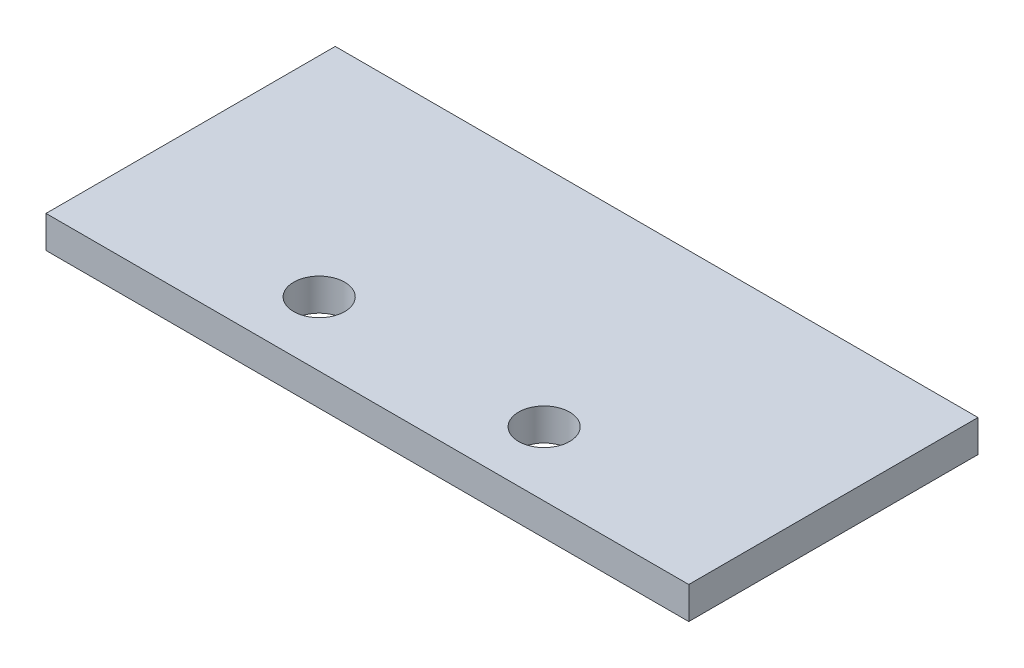
ISO-10303-21;
HEADER;
FILE_DESCRIPTION(('STEP AP214'),'2;1');
FILE_NAME('part.step','',(''),(''),'','','');
FILE_SCHEMA(('AUTOMOTIVE_DESIGN { 1 0 10303 214 1 1 1 1 }'));
ENDSEC;
DATA;
#1=APPLICATION_CONTEXT('core data for automotive mechanical design processes');
#2=APPLICATION_PROTOCOL_DEFINITION('international standard','automotive_design',2000,#1);
#3=PRODUCT_CONTEXT('',#1,'mechanical');
#4=PRODUCT('Part','Part','',(#3));
#5=PRODUCT_RELATED_PRODUCT_CATEGORY('part','',(#4));
#6=PRODUCT_DEFINITION_FORMATION('','',#4);
#7=PRODUCT_DEFINITION_CONTEXT('part definition',#1,'design');
#8=PRODUCT_DEFINITION('design','',#6,#7);
#9=PRODUCT_DEFINITION_SHAPE('','',#8);
#10=(LENGTH_UNIT() NAMED_UNIT(*) SI_UNIT(.MILLI.,.METRE.));
#11=(NAMED_UNIT(*) PLANE_ANGLE_UNIT() SI_UNIT($,.RADIAN.));
#12=(NAMED_UNIT(*) SI_UNIT($,.STERADIAN.) SOLID_ANGLE_UNIT());
#13=UNCERTAINTY_MEASURE_WITH_UNIT(LENGTH_MEASURE(1.E-05),#10,'distance_accuracy_value','');
#14=(GEOMETRIC_REPRESENTATION_CONTEXT(3) GLOBAL_UNCERTAINTY_ASSIGNED_CONTEXT((#13)) GLOBAL_UNIT_ASSIGNED_CONTEXT((#10,
#11,#12)) REPRESENTATION_CONTEXT('',''));
#15=CARTESIAN_POINT('',(0.,0.,0.));
#16=DIRECTION('',(0.,0.,1.));
#17=DIRECTION('',(1.,0.,0.));
#18=AXIS2_PLACEMENT_3D('',#15,#16,#17);
#19=CARTESIAN_POINT('',(0.,6.35,0.));
#20=DIRECTION('',(1.,0.,0.));
#21=DIRECTION('',(0.,0.,-1.));
#22=AXIS2_PLACEMENT_3D('',#19,#20,#21);
#23=PLANE('',#22);
#24=DIRECTION('',(0.,0.,1.));
#25=VECTOR('',#24,1.);
#26=CARTESIAN_POINT('',(0.,0.,0.));
#27=LINE('',#26,#25);
#28=CARTESIAN_POINT('',(0.,0.,-57.15));
#29=VERTEX_POINT('',#28);
#30=CARTESIAN_POINT('',(0.,0.,0.));
#31=VERTEX_POINT('',#30);
#32=EDGE_CURVE('E95',#29,#31,#27,.T.);
#33=ORIENTED_EDGE('',*,*,#32,.T.);
#34=DIRECTION('',(0.,-1.,0.));
#35=VECTOR('',#34,1.);
#36=CARTESIAN_POINT('',(0.,6.35,0.));
#37=LINE('',#36,#35);
#38=CARTESIAN_POINT('',(0.,6.35,0.));
#39=VERTEX_POINT('',#38);
#40=EDGE_CURVE('E11',#39,#31,#37,.T.);
#41=ORIENTED_EDGE('',*,*,#40,.F.);
#42=DIRECTION('',(0.,0.,1.));
#43=VECTOR('',#42,1.);
#44=CARTESIAN_POINT('',(0.,6.35,0.));
#45=LINE('',#44,#43);
#46=CARTESIAN_POINT('',(0.,6.35,-57.15));
#47=VERTEX_POINT('',#46);
#48=EDGE_CURVE('E83',#47,#39,#45,.T.);
#49=ORIENTED_EDGE('',*,*,#48,.F.);
#50=DIRECTION('',(0.,-1.,0.));
#51=VECTOR('',#50,1.);
#52=CARTESIAN_POINT('',(0.,6.35,-57.15));
#53=LINE('',#52,#51);
#54=EDGE_CURVE('E91',#47,#29,#53,.T.);
#55=ORIENTED_EDGE('',*,*,#54,.T.);
#56=EDGE_LOOP('',(#33,#41,#49,#55));
#57=FACE_BOUND('',#56,.T.);
#58=ADVANCED_FACE('F32',(#57),#23,.F.);
#59=CARTESIAN_POINT('',(0.,6.35,0.));
#60=DIRECTION('',(0.,0.,-1.));
#61=DIRECTION('',(-1.,0.,0.));
#62=AXIS2_PLACEMENT_3D('',#59,#60,#61);
#63=PLANE('',#62);
#64=DIRECTION('',(1.,0.,0.));
#65=VECTOR('',#64,1.);
#66=CARTESIAN_POINT('',(0.,0.,0.));
#67=LINE('',#66,#65);
#68=CARTESIAN_POINT('',(127.,0.,0.));
#69=VERTEX_POINT('',#68);
#70=EDGE_CURVE('E87',#31,#69,#67,.T.);
#71=ORIENTED_EDGE('',*,*,#70,.T.);
#72=DIRECTION('',(0.,-1.,0.));
#73=VECTOR('',#72,1.);
#74=CARTESIAN_POINT('',(127.,6.35,0.));
#75=LINE('',#74,#73);
#76=CARTESIAN_POINT('',(127.,6.35,0.));
#77=VERTEX_POINT('',#76);
#78=EDGE_CURVE('E40',#77,#69,#75,.T.);
#79=ORIENTED_EDGE('',*,*,#78,.F.);
#80=DIRECTION('',(1.,0.,0.));
#81=VECTOR('',#80,1.);
#82=CARTESIAN_POINT('',(0.,6.35,0.));
#83=LINE('',#82,#81);
#84=EDGE_CURVE('E78',#39,#77,#83,.T.);
#85=ORIENTED_EDGE('',*,*,#84,.F.);
#86=ORIENTED_EDGE('',*,*,#40,.T.);
#87=EDGE_LOOP('',(#71,#79,#85,#86));
#88=FACE_BOUND('',#87,.T.);
#89=ADVANCED_FACE('F86',(#88),#63,.F.);
#90=CARTESIAN_POINT('',(127.,6.35,0.));
#91=DIRECTION('',(-1.,0.,0.));
#92=DIRECTION('',(0.,0.,1.));
#93=AXIS2_PLACEMENT_3D('',#90,#91,#92);
#94=PLANE('',#93);
#95=DIRECTION('',(0.,0.,-1.));
#96=VECTOR('',#95,1.);
#97=CARTESIAN_POINT('',(127.,0.,0.));
#98=LINE('',#97,#96);
#99=CARTESIAN_POINT('',(127.,0.,-57.15));
#100=VERTEX_POINT('',#99);
#101=EDGE_CURVE('E65',#69,#100,#98,.T.);
#102=ORIENTED_EDGE('',*,*,#101,.T.);
#103=DIRECTION('',(0.,-1.,0.));
#104=VECTOR('',#103,1.);
#105=CARTESIAN_POINT('',(127.,6.35,-57.15));
#106=LINE('',#105,#104);
#107=CARTESIAN_POINT('',(127.,6.35,-57.15));
#108=VERTEX_POINT('',#107);
#109=EDGE_CURVE('E88',#108,#100,#106,.T.);
#110=ORIENTED_EDGE('',*,*,#109,.F.);
#111=DIRECTION('',(0.,0.,-1.));
#112=VECTOR('',#111,1.);
#113=CARTESIAN_POINT('',(127.,6.35,0.));
#114=LINE('',#113,#112);
#115=EDGE_CURVE('E81',#77,#108,#114,.T.);
#116=ORIENTED_EDGE('',*,*,#115,.F.);
#117=ORIENTED_EDGE('',*,*,#78,.T.);
#118=EDGE_LOOP('',(#102,#110,#116,#117));
#119=FACE_BOUND('',#118,.T.);
#120=ADVANCED_FACE('F89',(#119),#94,.F.);
#121=CARTESIAN_POINT('',(0.,6.35,-57.15));
#122=DIRECTION('',(0.,0.,1.));
#123=DIRECTION('',(1.,0.,0.));
#124=AXIS2_PLACEMENT_3D('',#121,#122,#123);
#125=PLANE('',#124);
#126=DIRECTION('',(-1.,0.,0.));
#127=VECTOR('',#126,1.);
#128=CARTESIAN_POINT('',(0.,0.,-57.15));
#129=LINE('',#128,#127);
#130=EDGE_CURVE('E71',#100,#29,#129,.T.);
#131=ORIENTED_EDGE('',*,*,#130,.T.);
#132=ORIENTED_EDGE('',*,*,#54,.F.);
#133=DIRECTION('',(-1.,0.,0.));
#134=VECTOR('',#133,1.);
#135=CARTESIAN_POINT('',(0.,6.35,-57.15));
#136=LINE('',#135,#134);
#137=EDGE_CURVE('E48',#108,#47,#136,.T.);
#138=ORIENTED_EDGE('',*,*,#137,.F.);
#139=ORIENTED_EDGE('',*,*,#109,.T.);
#140=EDGE_LOOP('',(#131,#132,#138,#139));
#141=FACE_BOUND('',#140,.T.);
#142=ADVANCED_FACE('F103',(#141),#125,.F.);
#143=CARTESIAN_POINT('',(0.,6.35,0.));
#144=DIRECTION('',(0.,-1.,0.));
#145=DIRECTION('',(0.,0.,-1.));
#146=AXIS2_PLACEMENT_3D('',#143,#144,#145);
#147=PLANE('',#146);
#148=CARTESIAN_POINT('',(85.7250000000008,6.35,-12.7000000000001));
#149=DIRECTION('',(0.,1.,0.));
#150=DIRECTION('',(0.,0.,1.));
#151=AXIS2_PLACEMENT_3D('',#148,#149,#150);
#152=CIRCLE('',#151,5.0419);
#153=CARTESIAN_POINT('',(85.7250000000008,6.35,-7.65810000000007));
#154=VERTEX_POINT('',#153);
#155=EDGE_CURVE('E115',#154,#154,#152,.T.);
#156=ORIENTED_EDGE('',*,*,#155,.F.);
#157=EDGE_LOOP('',(#156));
#158=FACE_BOUND('',#157,.T.);
#159=CARTESIAN_POINT('',(41.2750000000008,6.35,-12.7000000000001));
#160=DIRECTION('',(0.,1.,0.));
#161=DIRECTION('',(0.,0.,1.));
#162=AXIS2_PLACEMENT_3D('',#159,#160,#161);
#163=CIRCLE('',#162,5.0419);
#164=CARTESIAN_POINT('',(41.2750000000008,6.35,-7.65810000000007));
#165=VERTEX_POINT('',#164);
#166=EDGE_CURVE('E109',#165,#165,#163,.T.);
#167=ORIENTED_EDGE('',*,*,#166,.F.);
#168=EDGE_LOOP('',(#167));
#169=FACE_BOUND('',#168,.T.);
#170=ORIENTED_EDGE('',*,*,#48,.T.);
#171=ORIENTED_EDGE('',*,*,#84,.T.);
#172=ORIENTED_EDGE('',*,*,#115,.T.);
#173=ORIENTED_EDGE('',*,*,#137,.T.);
#174=EDGE_LOOP('',(#170,#171,#172,#173));
#175=FACE_BOUND('',#174,.T.);
#176=ADVANCED_FACE('F79',(#158,#169,#175),#147,.F.);
#177=CARTESIAN_POINT('',(0.,0.,0.));
#178=DIRECTION('',(0.,-1.,0.));
#179=DIRECTION('',(0.,0.,-1.));
#180=AXIS2_PLACEMENT_3D('',#177,#178,#179);
#181=PLANE('',#180);
#182=CARTESIAN_POINT('',(85.7250000000008,0.,-12.7000000000001));
#183=DIRECTION('',(0.,1.,0.));
#184=DIRECTION('',(0.,0.,1.));
#185=AXIS2_PLACEMENT_3D('',#182,#183,#184);
#186=CIRCLE('',#185,5.0419);
#187=CARTESIAN_POINT('',(85.7250000000008,0.,-7.65810000000007));
#188=VERTEX_POINT('',#187);
#189=EDGE_CURVE('E112',#188,#188,#186,.T.);
#190=ORIENTED_EDGE('',*,*,#189,.T.);
#191=EDGE_LOOP('',(#190));
#192=FACE_BOUND('',#191,.T.);
#193=CARTESIAN_POINT('',(41.2750000000008,0.,-12.7000000000001));
#194=DIRECTION('',(0.,1.,0.));
#195=DIRECTION('',(0.,0.,1.));
#196=AXIS2_PLACEMENT_3D('',#193,#194,#195);
#197=CIRCLE('',#196,5.0419);
#198=CARTESIAN_POINT('',(41.2750000000008,0.,-7.65810000000007));
#199=VERTEX_POINT('',#198);
#200=EDGE_CURVE('E98',#199,#199,#197,.T.);
#201=ORIENTED_EDGE('',*,*,#200,.T.);
#202=EDGE_LOOP('',(#201));
#203=FACE_BOUND('',#202,.T.);
#204=ORIENTED_EDGE('',*,*,#32,.F.);
#205=ORIENTED_EDGE('',*,*,#130,.F.);
#206=ORIENTED_EDGE('',*,*,#101,.F.);
#207=ORIENTED_EDGE('',*,*,#70,.F.);
#208=EDGE_LOOP('',(#204,#205,#206,#207));
#209=FACE_BOUND('',#208,.T.);
#210=ADVANCED_FACE('F106',(#192,#203,#209),#181,.T.);
#211=CARTESIAN_POINT('',(41.2750000000008,0.,-12.7000000000001));
#212=DIRECTION('',(0.,1.,0.));
#213=DIRECTION('',(0.,0.,1.));
#214=AXIS2_PLACEMENT_3D('',#211,#212,#213);
#215=CYLINDRICAL_SURFACE('',#214,5.0419);
#216=ORIENTED_EDGE('',*,*,#200,.F.);
#217=EDGE_LOOP('',(#216));
#218=FACE_BOUND('',#217,.T.);
#219=ORIENTED_EDGE('',*,*,#166,.T.);
#220=EDGE_LOOP('',(#219));
#221=FACE_BOUND('',#220,.T.);
#222=ADVANCED_FACE('F126',(#218,#221),#215,.F.);
#223=CARTESIAN_POINT('',(85.7250000000008,0.,-12.7000000000001));
#224=DIRECTION('',(0.,1.,0.));
#225=DIRECTION('',(0.,0.,1.));
#226=AXIS2_PLACEMENT_3D('',#223,#224,#225);
#227=CYLINDRICAL_SURFACE('',#226,5.0419);
#228=ORIENTED_EDGE('',*,*,#189,.F.);
#229=EDGE_LOOP('',(#228));
#230=FACE_BOUND('',#229,.T.);
#231=ORIENTED_EDGE('',*,*,#155,.T.);
#232=EDGE_LOOP('',(#231));
#233=FACE_BOUND('',#232,.T.);
#234=ADVANCED_FACE('F123',(#230,#233),#227,.F.);
#235=CLOSED_SHELL('',(#58,#89,#120,#142,#176,#210,#222,#234));
#236=MANIFOLD_SOLID_BREP('B2',#235);
#237=ADVANCED_BREP_SHAPE_REPRESENTATION('',(#18,#236),#14);
#238=SHAPE_DEFINITION_REPRESENTATION(#9,#237);
ENDSEC;
END-ISO-10303-21;
